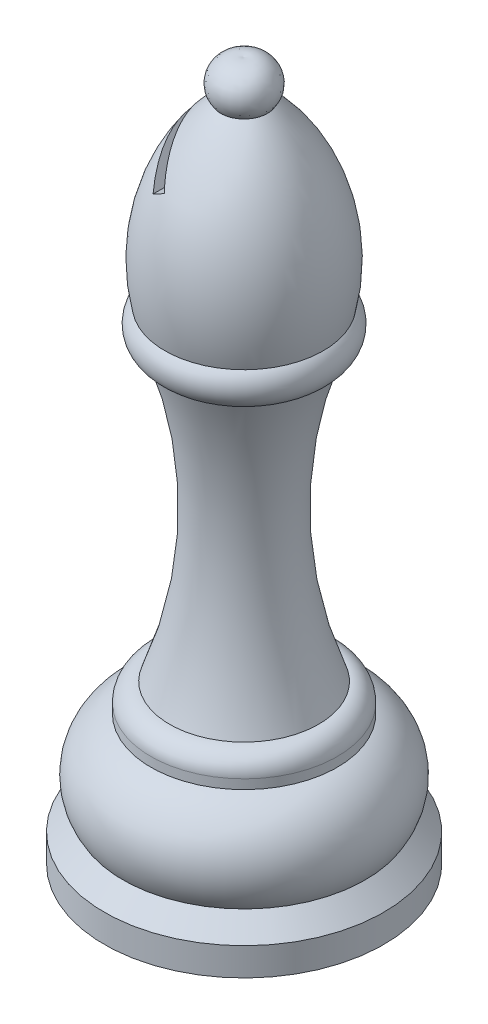
ISO-10303-21;
HEADER;
FILE_DESCRIPTION(('STEP AP214'),'2;1');
FILE_NAME('part.step','',(''),(''),'','','');
FILE_SCHEMA(('AUTOMOTIVE_DESIGN { 1 0 10303 214 1 1 1 1 }'));
ENDSEC;
DATA;
#1=APPLICATION_CONTEXT('core data for automotive mechanical design processes');
#2=APPLICATION_PROTOCOL_DEFINITION('international standard','automotive_design',2000,#1);
#3=PRODUCT_CONTEXT('',#1,'mechanical');
#4=PRODUCT('Part','Part','',(#3));
#5=PRODUCT_RELATED_PRODUCT_CATEGORY('part','',(#4));
#6=PRODUCT_DEFINITION_FORMATION('','',#4);
#7=PRODUCT_DEFINITION_CONTEXT('part definition',#1,'design');
#8=PRODUCT_DEFINITION('design','',#6,#7);
#9=PRODUCT_DEFINITION_SHAPE('','',#8);
#10=(LENGTH_UNIT() NAMED_UNIT(*) SI_UNIT(.MILLI.,.METRE.));
#11=(NAMED_UNIT(*) PLANE_ANGLE_UNIT() SI_UNIT($,.RADIAN.));
#12=(NAMED_UNIT(*) SI_UNIT($,.STERADIAN.) SOLID_ANGLE_UNIT());
#13=UNCERTAINTY_MEASURE_WITH_UNIT(LENGTH_MEASURE(1.E-05),#10,'distance_accuracy_value','');
#14=(GEOMETRIC_REPRESENTATION_CONTEXT(3) GLOBAL_UNCERTAINTY_ASSIGNED_CONTEXT((#13)) GLOBAL_UNIT_ASSIGNED_CONTEXT((#10,
#11,#12)) REPRESENTATION_CONTEXT('',''));
#15=CARTESIAN_POINT('',(0.,0.,0.));
#16=DIRECTION('',(0.,0.,1.));
#17=DIRECTION('',(1.,0.,0.));
#18=AXIS2_PLACEMENT_3D('',#15,#16,#17);
#19=CARTESIAN_POINT('',(0.,0.,0.));
#20=DIRECTION('',(0.,1.,0.));
#21=DIRECTION('',(0.,0.,1.));
#22=AXIS2_PLACEMENT_3D('',#19,#20,#21);
#23=PLANE('',#22);
#24=CARTESIAN_POINT('',(0.,0.,0.));
#25=DIRECTION('',(0.,-1.,0.));
#26=DIRECTION('',(0.,0.,-1.));
#27=AXIS2_PLACEMENT_3D('',#24,#25,#26);
#28=CIRCLE('',#27,15.);
#29=CARTESIAN_POINT('',(0.,0.,-15.));
#30=VERTEX_POINT('',#29);
#31=EDGE_CURVE('E71',#30,#30,#28,.T.);
#32=ORIENTED_EDGE('',*,*,#31,.T.);
#33=EDGE_LOOP('',(#32));
#34=FACE_BOUND('',#33,.T.);
#35=ADVANCED_FACE('F33',(#34),#23,.F.);
#36=CARTESIAN_POINT('',(0.,0.,0.));
#37=DIRECTION('',(0.,-1.,0.));
#38=DIRECTION('',(0.,0.,-1.));
#39=AXIS2_PLACEMENT_3D('',#36,#37,#38);
#40=CYLINDRICAL_SURFACE('',#39,15.);
#41=ORIENTED_EDGE('',*,*,#31,.F.);
#42=EDGE_LOOP('',(#41));
#43=FACE_BOUND('',#42,.T.);
#44=CARTESIAN_POINT('',(0.,3.,0.));
#45=DIRECTION('',(0.,-1.,0.));
#46=DIRECTION('',(0.,0.,-1.));
#47=AXIS2_PLACEMENT_3D('',#44,#45,#46);
#48=CIRCLE('',#47,15.);
#49=CARTESIAN_POINT('',(0.,3.,-15.));
#50=VERTEX_POINT('',#49);
#51=EDGE_CURVE('E110',#50,#50,#48,.T.);
#52=ORIENTED_EDGE('',*,*,#51,.T.);
#53=EDGE_LOOP('',(#52));
#54=FACE_BOUND('',#53,.T.);
#55=ADVANCED_FACE('F141',(#43,#54),#40,.T.);
#56=CARTESIAN_POINT('',(0.,5.,0.));
#57=DIRECTION('',(0.,-1.,0.));
#58=DIRECTION('',(0.,0.,-1.));
#59=AXIS2_PLACEMENT_3D('',#56,#57,#58);
#60=CONICAL_SURFACE('',#59,13.,0.785398163397449);
#61=ORIENTED_EDGE('',*,*,#51,.F.);
#62=EDGE_LOOP('',(#61));
#63=FACE_BOUND('',#62,.T.);
#64=CARTESIAN_POINT('',(0.,5.,0.));
#65=DIRECTION('',(0.,-1.,0.));
#66=DIRECTION('',(0.,0.,-1.));
#67=AXIS2_PLACEMENT_3D('',#64,#65,#66);
#68=CIRCLE('',#67,13.);
#69=CARTESIAN_POINT('',(0.,5.,-13.));
#70=VERTEX_POINT('',#69);
#71=EDGE_CURVE('E113',#70,#70,#68,.T.);
#72=ORIENTED_EDGE('',*,*,#71,.T.);
#73=EDGE_LOOP('',(#72));
#74=FACE_BOUND('',#73,.T.);
#75=ADVANCED_FACE('F146',(#63,#74),#60,.T.);
#76=CARTESIAN_POINT('',(0.,8.31380661428567,0.));
#77=DIRECTION('',(0.,-1.,0.));
#78=DIRECTION('',(0.,0.,-1.));
#79=AXIS2_PLACEMENT_3D('',#76,#77,#78);
#80=TOROIDAL_SURFACE('',#79,7.99813177671417,6.);
#81=ORIENTED_EDGE('',*,*,#71,.F.);
#82=EDGE_LOOP('',(#81));
#83=FACE_BOUND('',#82,.T.);
#84=CARTESIAN_POINT('',(0.,13.97,0.));
#85=DIRECTION('',(0.,-1.,0.));
#86=DIRECTION('',(0.,0.,-1.));
#87=AXIS2_PLACEMENT_3D('',#84,#85,#86);
#88=CIRCLE('',#87,10.);
#89=CARTESIAN_POINT('',(0.,13.97,-10.));
#90=VERTEX_POINT('',#89);
#91=EDGE_CURVE('E116',#90,#90,#88,.T.);
#92=ORIENTED_EDGE('',*,*,#91,.T.);
#93=EDGE_LOOP('',(#92));
#94=FACE_BOUND('',#93,.T.);
#95=ADVANCED_FACE('F154',(#83,#94),#80,.T.);
#96=CARTESIAN_POINT('',(0.,0.,0.));
#97=DIRECTION('',(0.,-1.,0.));
#98=DIRECTION('',(0.,0.,-1.));
#99=AXIS2_PLACEMENT_3D('',#96,#97,#98);
#100=CYLINDRICAL_SURFACE('',#99,10.);
#101=ORIENTED_EDGE('',*,*,#91,.F.);
#102=EDGE_LOOP('',(#101));
#103=FACE_BOUND('',#102,.T.);
#104=CARTESIAN_POINT('',(0.,14.97,0.));
#105=DIRECTION('',(0.,-1.,0.));
#106=DIRECTION('',(0.,0.,-1.));
#107=AXIS2_PLACEMENT_3D('',#104,#105,#106);
#108=CIRCLE('',#107,10.);
#109=CARTESIAN_POINT('',(0.,14.97,-10.));
#110=VERTEX_POINT('',#109);
#111=EDGE_CURVE('E119',#110,#110,#108,.T.);
#112=ORIENTED_EDGE('',*,*,#111,.T.);
#113=EDGE_LOOP('',(#112));
#114=FACE_BOUND('',#113,.T.);
#115=ADVANCED_FACE('F160',(#103,#114),#100,.T.);
#116=CARTESIAN_POINT('',(0.,14.97,0.));
#117=DIRECTION('',(0.,-1.,0.));
#118=DIRECTION('',(0.,0.,-1.));
#119=AXIS2_PLACEMENT_3D('',#116,#117,#118);
#120=TOROIDAL_SURFACE('',#119,7.99999999999981,2.00000000000009);
#121=ORIENTED_EDGE('',*,*,#111,.F.);
#122=EDGE_LOOP('',(#121));
#123=FACE_BOUND('',#122,.T.);
#124=CARTESIAN_POINT('',(0.,16.9700000000001,0.));
#125=DIRECTION('',(0.,-1.,0.));
#126=DIRECTION('',(0.,0.,-1.));
#127=AXIS2_PLACEMENT_3D('',#124,#125,#126);
#128=CIRCLE('',#127,7.99999999999981);
#129=CARTESIAN_POINT('',(0.,16.9700000000001,-7.99999999999981));
#130=VERTEX_POINT('',#129);
#131=EDGE_CURVE('E122',#130,#130,#128,.T.);
#132=ORIENTED_EDGE('',*,*,#131,.T.);
#133=EDGE_LOOP('',(#132));
#134=FACE_BOUND('',#133,.T.);
#135=ADVANCED_FACE('F166',(#123,#134),#120,.T.);
#136=CARTESIAN_POINT('',(0.,33.160793119901,0.));
#137=DIRECTION('',(0.,-1.,0.));
#138=DIRECTION('',(0.,0.,-1.));
#139=AXIS2_PLACEMENT_3D('',#136,#137,#138);
#140=TOROIDAL_SURFACE('',#139,49.9864051586766,45.);
#141=ORIENTED_EDGE('',*,*,#131,.F.);
#142=EDGE_LOOP('',(#141));
#143=FACE_BOUND('',#142,.T.);
#144=CARTESIAN_POINT('',(0.,47.99,0.));
#145=DIRECTION('',(0.,-1.,0.));
#146=DIRECTION('',(0.,0.,-1.));
#147=AXIS2_PLACEMENT_3D('',#144,#145,#146);
#148=CIRCLE('',#147,7.5);
#149=CARTESIAN_POINT('',(0.,47.99,-7.5));
#150=VERTEX_POINT('',#149);
#151=EDGE_CURVE('E125',#150,#150,#148,.T.);
#152=ORIENTED_EDGE('',*,*,#151,.T.);
#153=EDGE_LOOP('',(#152));
#154=FACE_BOUND('',#153,.T.);
#155=ADVANCED_FACE('F172',(#143,#154),#140,.F.);
#156=CARTESIAN_POINT('',(0.,50.2248549635829,0.));
#157=DIRECTION('',(0.,-1.,0.));
#158=DIRECTION('',(0.,0.,-1.));
#159=AXIS2_PLACEMENT_3D('',#156,#157,#158);
#160=TOROIDAL_SURFACE('',#159,6.95647144348345,2.3);
#161=ORIENTED_EDGE('',*,*,#151,.F.);
#162=EDGE_LOOP('',(#161));
#163=FACE_BOUND('',#162,.T.);
#164=CARTESIAN_POINT('',(0.,51.93,0.));
#165=DIRECTION('',(0.,-1.,0.));
#166=DIRECTION('',(0.,0.,-1.));
#167=AXIS2_PLACEMENT_3D('',#164,#165,#166);
#168=CIRCLE('',#167,8.5);
#169=CARTESIAN_POINT('',(0.,51.93,-8.5));
#170=VERTEX_POINT('',#169);
#171=EDGE_CURVE('E128',#170,#170,#168,.T.);
#172=ORIENTED_EDGE('',*,*,#171,.T.);
#173=EDGE_LOOP('',(#172));
#174=FACE_BOUND('',#173,.T.);
#175=ADVANCED_FACE('F178',(#163,#174),#160,.T.);
#176=CARTESIAN_POINT('',(0.,56.2576359524053,0.));
#177=DIRECTION('',(0.,-1.,0.));
#178=DIRECTION('',(0.,0.,-1.));
#179=AXIS2_PLACEMENT_3D('',#176,#177,#178);
#180=DEGENERATE_TOROIDAL_SURFACE('',#179,11.026176457859,20.,.F.);
#181=CARTESIAN_POINT('',(-3.04894037737312,64.0865967324121,-6.71835588330526));
#182=CARTESIAN_POINT('',(-2.9415075035803,64.1486231310162,-6.73813652117495));
#183=CARTESIAN_POINT('',(-2.83368339404512,64.2108754096814,-6.75507193085083));
#184=CARTESIAN_POINT('',(-2.6177001042128,64.3355734202066,-6.78323101570927));
#185=CARTESIAN_POINT('',(-2.50954205830972,64.3980184971237,-6.79446628784599));
#186=CARTESIAN_POINT('',(-2.29289269236189,64.5231010668735,-6.81128492366377));
#187=CARTESIAN_POINT('',(-2.18440135765044,64.5857385681739,-6.81686803493605));
#188=CARTESIAN_POINT('',(-1.96708864064956,64.7112041238326,-6.82240244771164));
#189=CARTESIAN_POINT('',(-1.85826703735634,64.7740323057876,-6.822342197396));
#190=CARTESIAN_POINT('',(-1.74950227169645,64.8368276725197,-6.81945936828843));
#191=B_SPLINE_CURVE_WITH_KNOTS('',3,(#181,#182,#183,#184,#185,#186,#187,#188,#189,#190),
.UNSPECIFIED.,.F.,.F.,(4,2,2,2,4),(0.,0.376824114914801,0.752878473900398,1.12894962562029,
1.50579060229975),.UNSPECIFIED.);
#192=CARTESIAN_POINT('',(-3.04874037737312,64.0867122024659,-6.71839270246336));
#193=VERTEX_POINT('',#192);
#194=CARTESIAN_POINT('',(-1.74970227169645,64.8367122024659,-6.81946466471569));
#195=VERTEX_POINT('',#194);
#196=EDGE_CURVE('E70',#193,#195,#191,.T.);
#197=ORIENTED_EDGE('',*,*,#196,.T.);
#198=CARTESIAN_POINT('',(-1.74958680164261,64.8365122024659,-6.81959233676399));
#199=CARTESIAN_POINT('',(-1.8268390026299,64.9703169395724,-6.73417310164745));
#200=CARTESIAN_POINT('',(-1.90325889361562,65.1026800734685,-6.6457750946448));
#201=CARTESIAN_POINT('',(-2.05429108942369,65.3642755101868,-6.46294914796433));
#202=CARTESIAN_POINT('',(-2.12890307564959,65.4935072611837,-6.36852015598927));
#203=CARTESIAN_POINT('',(-2.35022763780582,65.8768526478012,-6.07552193514902));
#204=CARTESIAN_POINT('',(-2.49394918249219,66.1257856653403,-5.86776880245476));
#205=CARTESIAN_POINT('',(-2.77381506923123,66.6105276004776,-5.4240335947338));
#206=CARTESIAN_POINT('',(-2.90980256105139,66.846064845504,-5.18765513312776));
#207=CARTESIAN_POINT('',(-3.16913338598375,67.2952390102556,-4.68904887128824));
#208=CARTESIAN_POINT('',(-3.29249610057513,67.5089094996875,-4.42686194414481));
#209=CARTESIAN_POINT('',(-3.46931652109558,67.8151714518446,-4.00496932702756));
#210=CARTESIAN_POINT('',(-3.52846268678993,67.9176156159001,-3.85475176406417));
#211=CARTESIAN_POINT('',(-3.64162199504957,68.1136132871552,-3.54682790495502));
#212=CARTESIAN_POINT('',(-3.69563521048973,68.2071669205777,-3.38912171517644));
#213=CARTESIAN_POINT('',(-3.84846324252943,68.4718728368912,-2.90596078855375));
#214=CARTESIAN_POINT('',(-3.93868704981779,68.628145055167,-2.56901734207462));
#215=CARTESIAN_POINT('',(-4.04475035391507,68.8118520866821,-2.07327910190429));
#216=CARTESIAN_POINT('',(-4.07330230567336,68.8613055177827,-1.92505999634704));
#217=CARTESIAN_POINT('',(-4.12449739530685,68.9499780141259,-1.62462291407472));
#218=CARTESIAN_POINT('',(-4.14714374743456,68.9892026466172,-1.47240716248899));
#219=CARTESIAN_POINT('',(-4.18598875007457,69.0564841648099,-1.16477135544409));
#220=CARTESIAN_POINT('',(-4.20218991710826,69.0845454092542,-1.00935257558678));
#221=CARTESIAN_POINT('',(-4.22771738230896,69.1287602759702,-0.696255271416723));
#222=CARTESIAN_POINT('',(-4.23704372568579,69.1449139765477,-0.53857676197123));
#223=CARTESIAN_POINT('',(-4.24856428801576,69.164868175835,-0.221518421971443));
#224=CARTESIAN_POINT('',(-4.250728910147,69.1686174113455,-0.0621342554606423));
#225=CARTESIAN_POINT('',(-4.24777488727086,69.1635008936373,0.256358532858061));
#226=CARTESIAN_POINT('',(-4.24265636283305,69.1546353492512,0.415467159183763));
#227=CARTESIAN_POINT('',(-4.22529007453638,69.1245560555825,0.732216137474439));
#228=CARTESIAN_POINT('',(-4.21303764071024,69.1033342176792,0.889855458866892));
#229=CARTESIAN_POINT('',(-4.18175982755952,69.0491594561526,1.20241511614955));
#230=CARTESIAN_POINT('',(-4.1627336437281,69.0162051390824,1.35733512677751));
#231=CARTESIAN_POINT('',(-4.11452293374728,68.9327017399266,1.69031204328515));
#232=CARTESIAN_POINT('',(-4.08414394430564,68.8800837867311,1.8676785331902));
#233=CARTESIAN_POINT('',(-4.01565028428301,68.7614492875756,2.21627516560233));
#234=CARTESIAN_POINT('',(-3.97753412604253,68.6954301649137,2.38750412055783));
#235=CARTESIAN_POINT('',(-3.85284822109671,68.4794678425598,2.89154722643891));
#236=CARTESIAN_POINT('',(-3.75599831188304,68.3117188790933,3.21434506233129));
#237=CARTESIAN_POINT('',(-3.57084721581655,67.9910277736291,3.74662101311185));
#238=CARTESIAN_POINT('',(-3.48736875248373,67.8464388337989,3.96306469556747));
#239=CARTESIAN_POINT('',(-3.3112795253884,67.5414433458042,4.38075583277889));
#240=CARTESIAN_POINT('',(-3.21866414917971,67.3810288086487,4.58199552088839));
#241=CARTESIAN_POINT('',(-3.02574216780592,67.0468781350124,4.96955410434938));
#242=CARTESIAN_POINT('',(-2.92542566759417,66.8731248598082,5.15585315275574));
#243=CARTESIAN_POINT('',(-2.71840748150243,66.5145588434065,5.51348071745868));
#244=CARTESIAN_POINT('',(-2.61170788788093,66.3297497261071,5.68481409441108));
#245=CARTESIAN_POINT('',(-2.38237847350275,65.9325395287341,6.02848801012065));
#246=CARTESIAN_POINT('',(-2.25920050661685,65.7191890317147,6.19936167639338));
#247=CARTESIAN_POINT('',(-2.0079547661723,65.2840186440794,6.52278987346206));
#248=CARTESIAN_POINT('',(-1.8799187922947,65.0622538321269,6.67544307839778));
#249=CARTESIAN_POINT('',(-1.74958680164261,64.8365122024659,6.81959233676399));
#250=B_SPLINE_CURVE_WITH_KNOTS('',3,(#198,#199,#200,#201,#202,#203,#204,#205,#206,#207,#208,
#209,#210,#211,#212,#213,#214,#215,#216,#217,#218,#219,#220,#221,#222,#223,#224,#225,#226,#227,
#228,#229,#230,#231,#232,#233,#234,#235,#236,#237,#238,#239,#240,#241,#242,#243,#244,#245,#246,
#247,#248,#249),.UNSPECIFIED.,.F.,.F.,(4,2,2,2,2,2,2,2,2,2,2,2,2,2,2,2,2,2,2,2,2,2,2,2,2,4),(0.,
0.529565501031835,1.05922365538855,2.12181435502512,3.20130361150359,4.2791099662473,
4.85232114030709,5.42552417500729,6.56625578344756,7.0424034404711,7.51829140020256,
7.9939933667659,8.46969220501762,8.94735449631989,9.42500888020636,9.90297629613801,
10.3810004984013,10.9426011732973,11.5043099320822,12.6288821927468,13.4480136883088,
14.2675608301027,15.0881792102855,15.9085300654789,16.8072361482795,17.7008302135194),.UNSPECIFIED.);
#251=CARTESIAN_POINT('',(-1.74970227169645,64.8367122024659,6.81946466471572));
#252=VERTEX_POINT('',#251);
#253=EDGE_CURVE('E11',#195,#252,#250,.T.);
#254=ORIENTED_EDGE('',*,*,#253,.T.);
#255=CARTESIAN_POINT('',(-1.74950227169645,64.8368276725197,6.81945936828843));
#256=CARTESIAN_POINT('',(-1.85826703735634,64.7740323057876,6.822342197396));
#257=CARTESIAN_POINT('',(-1.96708864064956,64.7112041238326,6.82240244771164));
#258=CARTESIAN_POINT('',(-2.18440135765043,64.5857385681739,6.81686803493605));
#259=CARTESIAN_POINT('',(-2.29289269236189,64.5231010668735,6.81128492366377));
#260=CARTESIAN_POINT('',(-2.50954205830972,64.3980184971237,6.79446628784599));
#261=CARTESIAN_POINT('',(-2.6177001042128,64.3355734202066,6.78323101570927));
#262=CARTESIAN_POINT('',(-2.83368339404512,64.2108754096814,6.75507193085083));
#263=CARTESIAN_POINT('',(-2.94150750358031,64.1486231310162,6.73813652117495));
#264=CARTESIAN_POINT('',(-3.04894037737312,64.0865967324121,6.71835588330526));
#265=B_SPLINE_CURVE_WITH_KNOTS('',3,(#255,#256,#257,#258,#259,#260,#261,#262,#263,#264),
.UNSPECIFIED.,.F.,.F.,(4,2,2,2,4),(0.,0.376840976679457,0.752912128399354,1.12896648738495,
1.50579060229975),.UNSPECIFIED.);
#266=CARTESIAN_POINT('',(-3.04874037737312,64.0867122024659,6.71839270246336));
#267=VERTEX_POINT('',#266);
#268=EDGE_CURVE('E46',#252,#267,#265,.T.);
#269=ORIENTED_EDGE('',*,*,#268,.T.);
#270=CARTESIAN_POINT('',(-3.04862490731928,64.0865122024659,6.71853852888727));
#271=CARTESIAN_POINT('',(-3.11698761051543,64.2049198777444,6.63220103791297));
#272=CARTESIAN_POINT('',(-3.18452908003993,64.3219051345787,6.54328681295366));
#273=CARTESIAN_POINT('',(-3.31783509342786,64.552797922721,6.36023504048673));
#274=CARTESIAN_POINT('',(-3.38359932668228,64.6667049160385,6.26609658860376));
#275=CARTESIAN_POINT('',(-3.57832062883822,65.0039721046886,5.97529139505291));
#276=CARTESIAN_POINT('',(-3.70435503158393,65.2222700937457,5.77067589667254));
#277=CARTESIAN_POINT('',(-3.94859260850286,65.6453019860868,5.33731862535775));
#278=CARTESIAN_POINT('',(-4.06667080120941,65.8498194151205,5.10829462718078));
#279=CARTESIAN_POINT('',(-4.2909905060008,66.238352540958,4.62842218317859));
#280=CARTESIAN_POINT('',(-4.39724680891793,66.4223938562349,4.37760172416391));
#281=CARTESIAN_POINT('',(-4.55667411578684,66.6985300518458,3.95655444315972));
#282=CARTESIAN_POINT('',(-4.61436503650936,66.7984536576726,3.79312985579047));
#283=CARTESIAN_POINT('',(-4.72372600017072,66.9878724030988,3.45837578707948));
#284=CARTESIAN_POINT('',(-4.77539641960227,67.0773681948026,3.28704680097653));
#285=CARTESIAN_POINT('',(-4.87175791540211,67.2442712014213,2.93746952136994));
#286=CARTESIAN_POINT('',(-4.91647299219079,67.3217199862836,2.75924779678259));
#287=CARTESIAN_POINT('',(-4.99829863000104,67.4634461483327,2.3959621556208));
#288=CARTESIAN_POINT('',(-5.03541083900099,67.5277263799017,2.21089973210678));
#289=CARTESIAN_POINT('',(-5.10162090599414,67.6424055799064,1.83240815847891));
#290=CARTESIAN_POINT('',(-5.13060938781098,67.6926151032474,1.63890194790195));
#291=CARTESIAN_POINT('',(-5.17912317510553,67.7766434477092,1.24717201201698));
#292=CARTESIAN_POINT('',(-5.19864870701547,67.810462661022,1.04894839970742));
#293=CARTESIAN_POINT('',(-5.22761029239588,67.8606255983686,0.649665579321347));
#294=CARTESIAN_POINT('',(-5.23705188498429,67.8769789164361,0.44860798951473));
#295=CARTESIAN_POINT('',(-5.24553637612896,67.8916744861751,0.0456264983112377));
#296=CARTESIAN_POINT('',(-5.24458072265573,67.890019245805,-0.156297278541114));
#297=CARTESIAN_POINT('',(-5.23323772634316,67.8703725998816,-0.528566283322275));
#298=CARTESIAN_POINT('',(-5.22429014065158,67.8548749268587,-0.69909453456334));
#299=CARTESIAN_POINT('',(-5.19914771663545,67.8113269710373,-1.03797268280052));
#300=CARTESIAN_POINT('',(-5.18295386724373,67.7832784011207,-1.20632287382239));
#301=CARTESIAN_POINT('',(-5.14368962727792,67.7152707425793,-1.53976199540633));
#302=CARTESIAN_POINT('',(-5.12061943052006,67.6753119896541,-1.70485101774766));
#303=CARTESIAN_POINT('',(-5.06806730402351,67.5842890365163,-2.03095598938936));
#304=CARTESIAN_POINT('',(-5.03858223239578,67.5332193943923,-2.19196989948172));
#305=CARTESIAN_POINT('',(-4.96428832329679,67.4045385691399,-2.55535744481924));
#306=CARTESIAN_POINT('',(-4.91751712931937,67.3235284848404,-2.75613097212504));
#307=CARTESIAN_POINT('',(-4.81531821030605,67.1465147646307,-3.14868061848674));
#308=CARTESIAN_POINT('',(-4.75988716653,67.050505380494,-3.3404532513095));
#309=CARTESIAN_POINT('',(-4.64121992808287,66.8449676943097,-3.71516768591782));
#310=CARTESIAN_POINT('',(-4.57795205721995,66.7353845274884,-3.89806919684898));
#311=CARTESIAN_POINT('',(-4.44479599864245,66.5047514686965,-4.2538514762732));
#312=CARTESIAN_POINT('',(-4.37490913665622,66.3837038729548,-4.42673424030279));
#313=CARTESIAN_POINT('',(-4.21156649641847,66.1007861210206,-4.80345152806067));
#314=CARTESIAN_POINT('',(-4.11652304679322,65.9361660373431,-5.00453357730774));
#315=CARTESIAN_POINT('',(-3.91881067812493,65.5937181695248,-5.39121848352288));
#316=CARTESIAN_POINT('',(-3.81613781689651,65.4158835573187,-5.57681323143342));
#317=CARTESIAN_POINT('',(-3.60561487380381,65.0512471237232,-5.93040357129306));
#318=CARTESIAN_POINT('',(-3.497842487869,64.8645798756312,-6.09858497299155));
#319=CARTESIAN_POINT('',(-3.27700999303556,64.4820867746175,-6.41980113861227));
#320=CARTESIAN_POINT('',(-3.16395721842318,64.2862736250522,-6.57285604252341));
#321=CARTESIAN_POINT('',(-3.04862490731928,64.0865122024659,-6.71853852888727));
#322=B_SPLINE_CURVE_WITH_KNOTS('',3,(#270,#271,#272,#273,#274,#275,#276,#277,#278,#279,#280,
#281,#282,#283,#284,#285,#286,#287,#288,#289,#290,#291,#292,#293,#294,#295,#296,#297,#298,#299,
#300,#301,#302,#303,#304,#305,#306,#307,#308,#309,#310,#311,#312,#313,#314,#315,#316,#317,#318,
#319,#320,#321),.UNSPECIFIED.,.F.,.F.,(4,2,2,2,2,2,2,2,2,2,2,2,2,2,2,2,2,2,2,2,2,2,2,2,2,4),(0.,
0.485050838447439,0.970185908451824,1.94293759302597,2.92849899165913,3.91281310989115,
4.51252750516515,5.11220437708409,5.70976373694945,6.30719343399388,6.91231766774094,
7.51742742118302,8.12220461601231,8.7268975877386,9.24066875020883,9.75436981720656,
10.2680564064316,10.7819951586829,11.4454996006274,12.1092589459545,12.7757945389224,
13.4421969116017,14.2713505126975,15.100935564611,15.9204805557726,16.7389192427174),.UNSPECIFIED.);
#323=EDGE_CURVE('E65',#267,#193,#322,.T.);
#324=ORIENTED_EDGE('',*,*,#323,.T.);
#325=EDGE_LOOP('',(#197,#254,#269,#324));
#326=FACE_BOUND('',#325,.T.);
#327=ORIENTED_EDGE('',*,*,#171,.F.);
#328=EDGE_LOOP('',(#327));
#329=FACE_BOUND('',#328,.T.);
#330=CARTESIAN_POINT('',(0.,70.99,0.));
#331=DIRECTION('',(0.,-1.,0.));
#332=DIRECTION('',(0.,0.,-1.));
#333=AXIS2_PLACEMENT_3D('',#330,#331,#332);
#334=CIRCLE('',#333,2.5);
#335=CARTESIAN_POINT('',(0.,70.99,-2.5));
#336=VERTEX_POINT('',#335);
#337=EDGE_CURVE('E131',#336,#336,#334,.T.);
#338=ORIENTED_EDGE('',*,*,#337,.T.);
#339=EDGE_LOOP('',(#338));
#340=FACE_BOUND('',#339,.T.);
#341=ADVANCED_FACE('F79',(#326,#329,#340),#180,.F.);
#342=CARTESIAN_POINT('',(0.,72.5627727171942,-0.556707438379512));
#343=DIRECTION('',(-1.,0.,0.));
#344=DIRECTION('',(0.,0.,-1.));
#345=AXIS2_PLACEMENT_3D('',#342,#343,#344);
#346=CIRCLE('',#345,2.5);
#347=TRIMMED_CURVE('',#346,(PARAMETER_VALUE(-1.79536201379674)),
(PARAMETER_VALUE(1.79536201379674)),.T.,.PARAMETER.);
#348=CARTESIAN_POINT('',(0.,72.5627727171942,0.));
#349=DIRECTION('',(0.,-1.,0.));
#350=AXIS1_PLACEMENT('',#348,#349);
#351=SURFACE_OF_REVOLUTION('',#347,#350);
#352=ORIENTED_EDGE('',*,*,#337,.F.);
#353=EDGE_LOOP('',(#352));
#354=FACE_BOUND('',#353,.T.);
#355=CARTESIAN_POINT('',(0.,75.,0.));
#356=VERTEX_POINT('',#355);
#357=VERTEX_LOOP('',#356);
#358=FACE_BOUND('',#357,.T.);
#359=ADVANCED_FACE('F102',(#354,#358),#351,.T.);
#360=CARTESIAN_POINT('',(-4.24970227169642,69.1668392213881,-15.));
#361=DIRECTION('',(0.866025403784441,0.499999999999995,0.));
#362=DIRECTION('',(-0.499999999999995,0.866025403784441,0.));
#363=AXIS2_PLACEMENT_3D('',#360,#361,#362);
#364=PLANE('',#363);
#365=DIRECTION('',(0.,0.,1.));
#366=VECTOR('',#365,1.);
#367=CARTESIAN_POINT('',(-1.74970227169645,64.8367122024659,-15.));
#368=LINE('',#367,#366);
#369=EDGE_CURVE('E77',#195,#252,#368,.T.);
#370=ORIENTED_EDGE('',*,*,#369,.T.);
#371=ORIENTED_EDGE('',*,*,#253,.F.);
#372=EDGE_LOOP('',(#370,#371));
#373=FACE_BOUND('',#372,.T.);
#374=ADVANCED_FACE('F97',(#373),#364,.F.);
#375=CARTESIAN_POINT('',(-1.74970227169645,64.8367122024659,-15.));
#376=DIRECTION('',(0.499999999999983,-0.866025403784448,0.));
#377=DIRECTION('',(0.866025403784448,0.499999999999983,0.));
#378=AXIS2_PLACEMENT_3D('',#375,#376,#377);
#379=PLANE('',#378);
#380=ORIENTED_EDGE('',*,*,#369,.F.);
#381=ORIENTED_EDGE('',*,*,#196,.F.);
#382=DIRECTION('',(0.,0.,1.));
#383=VECTOR('',#382,1.);
#384=CARTESIAN_POINT('',(-3.04874037737312,64.0867122024659,-15.));
#385=LINE('',#384,#383);
#386=EDGE_CURVE('E52',#193,#267,#385,.T.);
#387=ORIENTED_EDGE('',*,*,#386,.T.);
#388=ORIENTED_EDGE('',*,*,#268,.F.);
#389=EDGE_LOOP('',(#380,#381,#387,#388));
#390=FACE_BOUND('',#389,.T.);
#391=ADVANCED_FACE('F75',(#390),#379,.F.);
#392=CARTESIAN_POINT('',(-3.04874037737312,64.0867122024659,-15.));
#393=DIRECTION('',(-0.866025403784441,-0.499999999999997,0.));
#394=DIRECTION('',(0.499999999999997,-0.866025403784441,0.));
#395=AXIS2_PLACEMENT_3D('',#392,#393,#394);
#396=PLANE('',#395);
#397=ORIENTED_EDGE('',*,*,#386,.F.);
#398=ORIENTED_EDGE('',*,*,#323,.F.);
#399=EDGE_LOOP('',(#397,#398));
#400=FACE_BOUND('',#399,.T.);
#401=ADVANCED_FACE('F66',(#400),#396,.F.);
#402=CLOSED_SHELL('',(#35,#55,#75,#95,#115,#135,#155,#175,#341,#359,#374,#391,#401));
#403=MANIFOLD_SOLID_BREP('B2',#402);
#404=ADVANCED_BREP_SHAPE_REPRESENTATION('',(#18,#403),#14);
#405=SHAPE_DEFINITION_REPRESENTATION(#9,#404);
ENDSEC;
END-ISO-10303-21;
